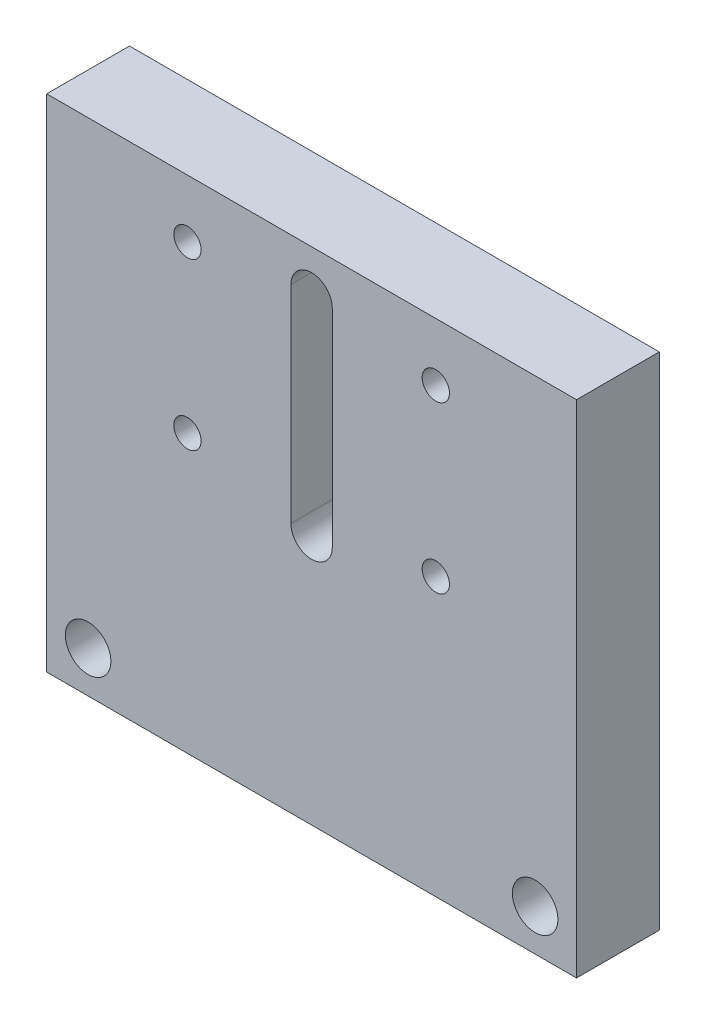
ISO-10303-21;
HEADER;
FILE_DESCRIPTION(('STEP AP214'),'2;1');
FILE_NAME('part.step','',(''),(''),'','','');
FILE_SCHEMA(('AUTOMOTIVE_DESIGN { 1 0 10303 214 1 1 1 1 }'));
ENDSEC;
DATA;
#1=APPLICATION_CONTEXT('core data for automotive mechanical design processes');
#2=APPLICATION_PROTOCOL_DEFINITION('international standard','automotive_design',2000,#1);
#3=PRODUCT_CONTEXT('',#1,'mechanical');
#4=PRODUCT('Part','Part','',(#3));
#5=PRODUCT_RELATED_PRODUCT_CATEGORY('part','',(#4));
#6=PRODUCT_DEFINITION_FORMATION('','',#4);
#7=PRODUCT_DEFINITION_CONTEXT('part definition',#1,'design');
#8=PRODUCT_DEFINITION('design','',#6,#7);
#9=PRODUCT_DEFINITION_SHAPE('','',#8);
#10=(LENGTH_UNIT() NAMED_UNIT(*) SI_UNIT(.MILLI.,.METRE.));
#11=(NAMED_UNIT(*) PLANE_ANGLE_UNIT() SI_UNIT($,.RADIAN.));
#12=(NAMED_UNIT(*) SI_UNIT($,.STERADIAN.) SOLID_ANGLE_UNIT());
#13=UNCERTAINTY_MEASURE_WITH_UNIT(LENGTH_MEASURE(1.E-05),#10,'distance_accuracy_value','');
#14=(GEOMETRIC_REPRESENTATION_CONTEXT(3) GLOBAL_UNCERTAINTY_ASSIGNED_CONTEXT((#13)) GLOBAL_UNIT_ASSIGNED_CONTEXT((#10,
#11,#12)) REPRESENTATION_CONTEXT('',''));
#15=CARTESIAN_POINT('',(0.,0.,0.));
#16=DIRECTION('',(0.,0.,1.));
#17=DIRECTION('',(1.,0.,0.));
#18=AXIS2_PLACEMENT_3D('',#15,#16,#17);
#19=CARTESIAN_POINT('',(64.,60.5,-10.));
#20=DIRECTION('',(0.,-1.,0.));
#21=DIRECTION('',(0.,0.,-1.));
#22=AXIS2_PLACEMENT_3D('',#19,#20,#21);
#23=PLANE('',#22);
#24=DIRECTION('',(0.,0.,1.));
#25=VECTOR('',#24,1.);
#26=CARTESIAN_POINT('',(0.,60.5,-10.));
#27=LINE('',#26,#25);
#28=CARTESIAN_POINT('',(0.,60.5,-10.));
#29=VERTEX_POINT('',#28);
#30=CARTESIAN_POINT('',(0.,60.5,0.));
#31=VERTEX_POINT('',#30);
#32=EDGE_CURVE('E127',#29,#31,#27,.T.);
#33=ORIENTED_EDGE('',*,*,#32,.T.);
#34=DIRECTION('',(-1.,0.,0.));
#35=VECTOR('',#34,1.);
#36=CARTESIAN_POINT('',(64.,60.5,0.));
#37=LINE('',#36,#35);
#38=CARTESIAN_POINT('',(64.,60.5,0.));
#39=VERTEX_POINT('',#38);
#40=EDGE_CURVE('E11',#39,#31,#37,.T.);
#41=ORIENTED_EDGE('',*,*,#40,.F.);
#42=DIRECTION('',(0.,0.,1.));
#43=VECTOR('',#42,1.);
#44=CARTESIAN_POINT('',(64.,60.5,-10.));
#45=LINE('',#44,#43);
#46=CARTESIAN_POINT('',(64.,60.5,-10.));
#47=VERTEX_POINT('',#46);
#48=EDGE_CURVE('E123',#47,#39,#45,.T.);
#49=ORIENTED_EDGE('',*,*,#48,.F.);
#50=DIRECTION('',(-1.,0.,0.));
#51=VECTOR('',#50,1.);
#52=CARTESIAN_POINT('',(64.,60.5,-10.));
#53=LINE('',#52,#51);
#54=EDGE_CURVE('E104',#47,#29,#53,.T.);
#55=ORIENTED_EDGE('',*,*,#54,.T.);
#56=EDGE_LOOP('',(#33,#41,#49,#55));
#57=FACE_BOUND('',#56,.T.);
#58=ADVANCED_FACE('F34',(#57),#23,.F.);
#59=CARTESIAN_POINT('',(64.,60.5,0.));
#60=DIRECTION('',(0.,0.,-1.));
#61=DIRECTION('',(0.,1.,0.));
#62=AXIS2_PLACEMENT_3D('',#59,#60,#61);
#63=PLANE('',#62);
#64=CARTESIAN_POINT('',(17.,53.5,0.));
#65=DIRECTION('',(0.,0.,-1.));
#66=DIRECTION('',(0.,1.,0.));
#67=AXIS2_PLACEMENT_3D('',#64,#65,#66);
#68=CIRCLE('',#67,1.65);
#69=CARTESIAN_POINT('',(17.,55.15,0.));
#70=VERTEX_POINT('',#69);
#71=EDGE_CURVE('E198',#70,#70,#68,.T.);
#72=ORIENTED_EDGE('',*,*,#71,.T.);
#73=EDGE_LOOP('',(#72));
#74=FACE_BOUND('',#73,.T.);
#75=CARTESIAN_POINT('',(47.,33.5,0.));
#76=DIRECTION('',(0.,0.,-1.));
#77=DIRECTION('',(0.,1.,0.));
#78=AXIS2_PLACEMENT_3D('',#75,#76,#77);
#79=CIRCLE('',#78,1.65);
#80=CARTESIAN_POINT('',(47.,35.15,0.));
#81=VERTEX_POINT('',#80);
#82=EDGE_CURVE('E192',#81,#81,#79,.T.);
#83=ORIENTED_EDGE('',*,*,#82,.T.);
#84=EDGE_LOOP('',(#83));
#85=FACE_BOUND('',#84,.T.);
#86=CARTESIAN_POINT('',(17.,33.5,0.));
#87=DIRECTION('',(0.,0.,-1.));
#88=DIRECTION('',(0.,1.,0.));
#89=AXIS2_PLACEMENT_3D('',#86,#87,#88);
#90=CIRCLE('',#89,1.65);
#91=CARTESIAN_POINT('',(17.,35.15,0.));
#92=VERTEX_POINT('',#91);
#93=EDGE_CURVE('E186',#92,#92,#90,.T.);
#94=ORIENTED_EDGE('',*,*,#93,.T.);
#95=EDGE_LOOP('',(#94));
#96=FACE_BOUND('',#95,.T.);
#97=CARTESIAN_POINT('',(47.,53.5,0.));
#98=DIRECTION('',(0.,0.,-1.));
#99=DIRECTION('',(0.,1.,0.));
#100=AXIS2_PLACEMENT_3D('',#97,#98,#99);
#101=CIRCLE('',#100,1.65);
#102=CARTESIAN_POINT('',(47.,55.15,0.));
#103=VERTEX_POINT('',#102);
#104=EDGE_CURVE('E178',#103,#103,#101,.T.);
#105=ORIENTED_EDGE('',*,*,#104,.T.);
#106=EDGE_LOOP('',(#105));
#107=FACE_BOUND('',#106,.T.);
#108=CARTESIAN_POINT('',(5.,5.,0.));
#109=DIRECTION('',(0.,0.,-1.));
#110=DIRECTION('',(-1.,0.,0.));
#111=AXIS2_PLACEMENT_3D('',#108,#109,#110);
#112=CIRCLE('',#111,2.75);
#113=CARTESIAN_POINT('',(2.25,5.,0.));
#114=VERTEX_POINT('',#113);
#115=EDGE_CURVE('E175',#114,#114,#112,.T.);
#116=ORIENTED_EDGE('',*,*,#115,.T.);
#117=EDGE_LOOP('',(#116));
#118=FACE_BOUND('',#117,.T.);
#119=CARTESIAN_POINT('',(59.,5.,0.));
#120=DIRECTION('',(0.,0.,1.));
#121=DIRECTION('',(1.,0.,0.));
#122=AXIS2_PLACEMENT_3D('',#119,#120,#121);
#123=CIRCLE('',#122,2.75);
#124=CARTESIAN_POINT('',(61.75,5.,0.));
#125=VERTEX_POINT('',#124);
#126=EDGE_CURVE('E169',#125,#125,#123,.T.);
#127=ORIENTED_EDGE('',*,*,#126,.F.);
#128=EDGE_LOOP('',(#127));
#129=FACE_BOUND('',#128,.T.);
#130=DIRECTION('',(0.,1.,0.));
#131=VECTOR('',#130,1.);
#132=CARTESIAN_POINT('',(29.5,55.3,0.));
#133=LINE('',#132,#131);
#134=CARTESIAN_POINT('',(29.5,30.3,0.));
#135=VERTEX_POINT('',#134);
#136=CARTESIAN_POINT('',(29.5,55.3,0.));
#137=VERTEX_POINT('',#136);
#138=EDGE_CURVE('E145',#135,#137,#133,.T.);
#139=ORIENTED_EDGE('',*,*,#138,.T.);
#140=CARTESIAN_POINT('',(32.,55.3,0.));
#141=DIRECTION('',(0.,0.,-1.));
#142=DIRECTION('',(0.,1.,0.));
#143=AXIS2_PLACEMENT_3D('',#140,#141,#142);
#144=CIRCLE('',#143,2.5);
#145=CARTESIAN_POINT('',(34.5,55.3,0.));
#146=VERTEX_POINT('',#145);
#147=EDGE_CURVE('E153',#137,#146,#144,.T.);
#148=ORIENTED_EDGE('',*,*,#147,.T.);
#149=DIRECTION('',(0.,-1.,0.));
#150=VECTOR('',#149,1.);
#151=CARTESIAN_POINT('',(34.5,55.3,0.));
#152=LINE('',#151,#150);
#153=CARTESIAN_POINT('',(34.5,30.3,0.));
#154=VERTEX_POINT('',#153);
#155=EDGE_CURVE('E164',#146,#154,#152,.T.);
#156=ORIENTED_EDGE('',*,*,#155,.T.);
#157=CARTESIAN_POINT('',(32.,30.3,0.));
#158=DIRECTION('',(0.,0.,-1.));
#159=DIRECTION('',(0.,1.,0.));
#160=AXIS2_PLACEMENT_3D('',#157,#158,#159);
#161=CIRCLE('',#160,2.5);
#162=EDGE_CURVE('E56',#154,#135,#161,.T.);
#163=ORIENTED_EDGE('',*,*,#162,.T.);
#164=EDGE_LOOP('',(#139,#148,#156,#163));
#165=FACE_BOUND('',#164,.T.);
#166=DIRECTION('',(0.,-1.,0.));
#167=VECTOR('',#166,1.);
#168=CARTESIAN_POINT('',(0.,60.5,0.));
#169=LINE('',#168,#167);
#170=CARTESIAN_POINT('',(0.,0.,0.));
#171=VERTEX_POINT('',#170);
#172=EDGE_CURVE('E130',#31,#171,#169,.T.);
#173=ORIENTED_EDGE('',*,*,#172,.T.);
#174=DIRECTION('',(-1.,0.,0.));
#175=VECTOR('',#174,1.);
#176=CARTESIAN_POINT('',(64.,0.,0.));
#177=LINE('',#176,#175);
#178=CARTESIAN_POINT('',(64.,0.,0.));
#179=VERTEX_POINT('',#178);
#180=EDGE_CURVE('E41',#179,#171,#177,.T.);
#181=ORIENTED_EDGE('',*,*,#180,.F.);
#182=DIRECTION('',(0.,-1.,0.));
#183=VECTOR('',#182,1.);
#184=CARTESIAN_POINT('',(64.,60.5,0.));
#185=LINE('',#184,#183);
#186=EDGE_CURVE('E120',#39,#179,#185,.T.);
#187=ORIENTED_EDGE('',*,*,#186,.F.);
#188=ORIENTED_EDGE('',*,*,#40,.T.);
#189=EDGE_LOOP('',(#173,#181,#187,#188));
#190=FACE_BOUND('',#189,.T.);
#191=ADVANCED_FACE('F138',(#74,#85,#96,#107,#118,#129,#165,#190),#63,.F.);
#192=CARTESIAN_POINT('',(64.,0.,0.));
#193=DIRECTION('',(0.,1.,0.));
#194=DIRECTION('',(0.,0.,1.));
#195=AXIS2_PLACEMENT_3D('',#192,#193,#194);
#196=PLANE('',#195);
#197=DIRECTION('',(0.,0.,-1.));
#198=VECTOR('',#197,1.);
#199=CARTESIAN_POINT('',(0.,0.,0.));
#200=LINE('',#199,#198);
#201=CARTESIAN_POINT('',(0.,0.,-10.));
#202=VERTEX_POINT('',#201);
#203=EDGE_CURVE('E115',#171,#202,#200,.T.);
#204=ORIENTED_EDGE('',*,*,#203,.T.);
#205=DIRECTION('',(1.,0.,0.));
#206=VECTOR('',#205,1.);
#207=CARTESIAN_POINT('',(64.,0.,-10.));
#208=LINE('',#207,#206);
#209=CARTESIAN_POINT('',(64.,0.,-10.));
#210=VERTEX_POINT('',#209);
#211=EDGE_CURVE('E101',#202,#210,#208,.T.);
#212=ORIENTED_EDGE('',*,*,#211,.T.);
#213=DIRECTION('',(0.,0.,-1.));
#214=VECTOR('',#213,1.);
#215=CARTESIAN_POINT('',(64.,0.,0.));
#216=LINE('',#215,#214);
#217=EDGE_CURVE('E109',#179,#210,#216,.T.);
#218=ORIENTED_EDGE('',*,*,#217,.F.);
#219=ORIENTED_EDGE('',*,*,#180,.T.);
#220=EDGE_LOOP('',(#204,#212,#218,#219));
#221=FACE_BOUND('',#220,.T.);
#222=ADVANCED_FACE('F113',(#221),#196,.F.);
#223=CARTESIAN_POINT('',(64.,9.99999999999999,-9.99999999999999));
#224=DIRECTION('',(0.,0.,1.));
#225=DIRECTION('',(0.,-1.,0.));
#226=AXIS2_PLACEMENT_3D('',#223,#224,#225);
#227=PLANE('',#226);
#228=CARTESIAN_POINT('',(17.,53.5,-10.));
#229=DIRECTION('',(0.,0.,-1.));
#230=DIRECTION('',(0.,1.,0.));
#231=AXIS2_PLACEMENT_3D('',#228,#229,#230);
#232=CIRCLE('',#231,1.64999999999999);
#233=CARTESIAN_POINT('',(17.,55.15,-10.));
#234=VERTEX_POINT('',#233);
#235=EDGE_CURVE('E201',#234,#234,#232,.T.);
#236=ORIENTED_EDGE('',*,*,#235,.F.);
#237=EDGE_LOOP('',(#236));
#238=FACE_BOUND('',#237,.T.);
#239=CARTESIAN_POINT('',(47.,33.5,-10.));
#240=DIRECTION('',(0.,0.,-1.));
#241=DIRECTION('',(0.,1.,0.));
#242=AXIS2_PLACEMENT_3D('',#239,#240,#241);
#243=CIRCLE('',#242,1.64999999999998);
#244=CARTESIAN_POINT('',(47.,35.15,-10.));
#245=VERTEX_POINT('',#244);
#246=EDGE_CURVE('E195',#245,#245,#243,.T.);
#247=ORIENTED_EDGE('',*,*,#246,.F.);
#248=EDGE_LOOP('',(#247));
#249=FACE_BOUND('',#248,.T.);
#250=CARTESIAN_POINT('',(17.,33.5,-10.));
#251=DIRECTION('',(0.,0.,-1.));
#252=DIRECTION('',(0.,1.,0.));
#253=AXIS2_PLACEMENT_3D('',#250,#251,#252);
#254=CIRCLE('',#253,1.64999999999999);
#255=CARTESIAN_POINT('',(17.,35.15,-10.));
#256=VERTEX_POINT('',#255);
#257=EDGE_CURVE('E189',#256,#256,#254,.T.);
#258=ORIENTED_EDGE('',*,*,#257,.F.);
#259=EDGE_LOOP('',(#258));
#260=FACE_BOUND('',#259,.T.);
#261=CARTESIAN_POINT('',(47.,53.5,-10.));
#262=DIRECTION('',(0.,0.,-1.));
#263=DIRECTION('',(0.,1.,0.));
#264=AXIS2_PLACEMENT_3D('',#261,#262,#263);
#265=CIRCLE('',#264,1.64999999999998);
#266=CARTESIAN_POINT('',(47.,55.15,-10.));
#267=VERTEX_POINT('',#266);
#268=EDGE_CURVE('E183',#267,#267,#265,.T.);
#269=ORIENTED_EDGE('',*,*,#268,.F.);
#270=EDGE_LOOP('',(#269));
#271=FACE_BOUND('',#270,.T.);
#272=CARTESIAN_POINT('',(5.,5.,-10.));
#273=DIRECTION('',(0.,0.,-1.));
#274=DIRECTION('',(-1.,0.,0.));
#275=AXIS2_PLACEMENT_3D('',#272,#273,#274);
#276=CIRCLE('',#275,2.75);
#277=CARTESIAN_POINT('',(2.25,5.,-10.));
#278=VERTEX_POINT('',#277);
#279=EDGE_CURVE('E172',#278,#278,#276,.T.);
#280=ORIENTED_EDGE('',*,*,#279,.F.);
#281=EDGE_LOOP('',(#280));
#282=FACE_BOUND('',#281,.T.);
#283=CARTESIAN_POINT('',(59.,5.,-10.));
#284=DIRECTION('',(0.,0.,1.));
#285=DIRECTION('',(1.,0.,0.));
#286=AXIS2_PLACEMENT_3D('',#283,#284,#285);
#287=CIRCLE('',#286,2.75);
#288=CARTESIAN_POINT('',(61.75,5.,-10.));
#289=VERTEX_POINT('',#288);
#290=EDGE_CURVE('E117',#289,#289,#287,.T.);
#291=ORIENTED_EDGE('',*,*,#290,.T.);
#292=EDGE_LOOP('',(#291));
#293=FACE_BOUND('',#292,.T.);
#294=DIRECTION('',(0.,-1.,0.));
#295=VECTOR('',#294,1.);
#296=CARTESIAN_POINT('',(34.5,55.3,-9.99999999999999));
#297=LINE('',#296,#295);
#298=CARTESIAN_POINT('',(34.5,55.3,-10.));
#299=VERTEX_POINT('',#298);
#300=CARTESIAN_POINT('',(34.5,30.3,-9.99999999999999));
#301=VERTEX_POINT('',#300);
#302=EDGE_CURVE('E157',#299,#301,#297,.T.);
#303=ORIENTED_EDGE('',*,*,#302,.F.);
#304=CARTESIAN_POINT('',(32.,55.3,-9.99999999999999));
#305=DIRECTION('',(0.,0.,-1.));
#306=DIRECTION('',(0.,1.,0.));
#307=AXIS2_PLACEMENT_3D('',#304,#305,#306);
#308=CIRCLE('',#307,2.5);
#309=CARTESIAN_POINT('',(29.5,55.3,-9.99999999999999));
#310=VERTEX_POINT('',#309);
#311=EDGE_CURVE('E116',#310,#299,#308,.T.);
#312=ORIENTED_EDGE('',*,*,#311,.F.);
#313=DIRECTION('',(0.,1.,0.));
#314=VECTOR('',#313,1.);
#315=CARTESIAN_POINT('',(29.5,55.3,-9.99999999999999));
#316=LINE('',#315,#314);
#317=CARTESIAN_POINT('',(29.5,30.3,-9.99999999999999));
#318=VERTEX_POINT('',#317);
#319=EDGE_CURVE('E150',#318,#310,#316,.T.);
#320=ORIENTED_EDGE('',*,*,#319,.F.);
#321=CARTESIAN_POINT('',(32.,30.3,-9.99999999999999));
#322=DIRECTION('',(0.,0.,-1.));
#323=DIRECTION('',(0.,1.,0.));
#324=AXIS2_PLACEMENT_3D('',#321,#322,#323);
#325=CIRCLE('',#324,2.5);
#326=EDGE_CURVE('E154',#301,#318,#325,.T.);
#327=ORIENTED_EDGE('',*,*,#326,.F.);
#328=EDGE_LOOP('',(#303,#312,#320,#327));
#329=FACE_BOUND('',#328,.T.);
#330=DIRECTION('',(0.,1.,0.));
#331=VECTOR('',#330,1.);
#332=CARTESIAN_POINT('',(0.,9.99999999999999,-9.99999999999999));
#333=LINE('',#332,#331);
#334=EDGE_CURVE('E48',#202,#29,#333,.T.);
#335=ORIENTED_EDGE('',*,*,#334,.T.);
#336=ORIENTED_EDGE('',*,*,#54,.F.);
#337=DIRECTION('',(0.,1.,0.));
#338=VECTOR('',#337,1.);
#339=CARTESIAN_POINT('',(64.,9.99999999999999,-9.99999999999999));
#340=LINE('',#339,#338);
#341=EDGE_CURVE('E98',#210,#47,#340,.T.);
#342=ORIENTED_EDGE('',*,*,#341,.F.);
#343=ORIENTED_EDGE('',*,*,#211,.F.);
#344=EDGE_LOOP('',(#335,#336,#342,#343));
#345=FACE_BOUND('',#344,.T.);
#346=ADVANCED_FACE('F100',(#238,#249,#260,#271,#282,#293,#329,#345),#227,.F.);
#347=CARTESIAN_POINT('',(64.,0.,0.));
#348=DIRECTION('',(1.,0.,0.));
#349=DIRECTION('',(0.,0.,-1.));
#350=AXIS2_PLACEMENT_3D('',#347,#348,#349);
#351=PLANE('',#350);
#352=ORIENTED_EDGE('',*,*,#217,.T.);
#353=ORIENTED_EDGE('',*,*,#341,.T.);
#354=ORIENTED_EDGE('',*,*,#48,.T.);
#355=ORIENTED_EDGE('',*,*,#186,.T.);
#356=EDGE_LOOP('',(#352,#353,#354,#355));
#357=FACE_BOUND('',#356,.T.);
#358=ADVANCED_FACE('F119',(#357),#351,.T.);
#359=CARTESIAN_POINT('',(0.,0.,0.));
#360=DIRECTION('',(1.,0.,0.));
#361=DIRECTION('',(0.,0.,-1.));
#362=AXIS2_PLACEMENT_3D('',#359,#360,#361);
#363=PLANE('',#362);
#364=ORIENTED_EDGE('',*,*,#334,.F.);
#365=ORIENTED_EDGE('',*,*,#203,.F.);
#366=ORIENTED_EDGE('',*,*,#172,.F.);
#367=ORIENTED_EDGE('',*,*,#32,.F.);
#368=EDGE_LOOP('',(#364,#365,#366,#367));
#369=FACE_BOUND('',#368,.T.);
#370=ADVANCED_FACE('F136',(#369),#363,.F.);
#371=CARTESIAN_POINT('',(32.,55.3,0.));
#372=DIRECTION('',(0.,0.,-1.));
#373=DIRECTION('',(0.,1.,0.));
#374=AXIS2_PLACEMENT_3D('',#371,#372,#373);
#375=CYLINDRICAL_SURFACE('',#374,2.5);
#376=ORIENTED_EDGE('',*,*,#311,.T.);
#377=DIRECTION('',(0.,0.,-1.));
#378=VECTOR('',#377,1.);
#379=CARTESIAN_POINT('',(34.5,55.3,0.));
#380=LINE('',#379,#378);
#381=EDGE_CURVE('E141',#146,#299,#380,.T.);
#382=ORIENTED_EDGE('',*,*,#381,.F.);
#383=ORIENTED_EDGE('',*,*,#147,.F.);
#384=DIRECTION('',(0.,0.,-1.));
#385=VECTOR('',#384,1.);
#386=CARTESIAN_POINT('',(29.5,55.3,0.));
#387=LINE('',#386,#385);
#388=EDGE_CURVE('E131',#137,#310,#387,.T.);
#389=ORIENTED_EDGE('',*,*,#388,.T.);
#390=EDGE_LOOP('',(#376,#382,#383,#389));
#391=FACE_BOUND('',#390,.T.);
#392=ADVANCED_FACE('F229',(#391),#375,.F.);
#393=CARTESIAN_POINT('',(29.5,55.3,0.));
#394=DIRECTION('',(-1.,0.,0.));
#395=DIRECTION('',(0.,-1.,0.));
#396=AXIS2_PLACEMENT_3D('',#393,#394,#395);
#397=PLANE('',#396);
#398=ORIENTED_EDGE('',*,*,#319,.T.);
#399=ORIENTED_EDGE('',*,*,#388,.F.);
#400=ORIENTED_EDGE('',*,*,#138,.F.);
#401=DIRECTION('',(0.,0.,-1.));
#402=VECTOR('',#401,1.);
#403=CARTESIAN_POINT('',(29.5,30.3,0.));
#404=LINE('',#403,#402);
#405=EDGE_CURVE('E147',#135,#318,#404,.T.);
#406=ORIENTED_EDGE('',*,*,#405,.T.);
#407=EDGE_LOOP('',(#398,#399,#400,#406));
#408=FACE_BOUND('',#407,.T.);
#409=ADVANCED_FACE('F232',(#408),#397,.F.);
#410=CARTESIAN_POINT('',(32.,30.3,0.));
#411=DIRECTION('',(0.,0.,-1.));
#412=DIRECTION('',(0.,1.,0.));
#413=AXIS2_PLACEMENT_3D('',#410,#411,#412);
#414=CYLINDRICAL_SURFACE('',#413,2.5);
#415=ORIENTED_EDGE('',*,*,#326,.T.);
#416=ORIENTED_EDGE('',*,*,#405,.F.);
#417=ORIENTED_EDGE('',*,*,#162,.F.);
#418=DIRECTION('',(0.,0.,-1.));
#419=VECTOR('',#418,1.);
#420=CARTESIAN_POINT('',(34.5,30.3,0.));
#421=LINE('',#420,#419);
#422=EDGE_CURVE('E144',#154,#301,#421,.T.);
#423=ORIENTED_EDGE('',*,*,#422,.T.);
#424=EDGE_LOOP('',(#415,#416,#417,#423));
#425=FACE_BOUND('',#424,.T.);
#426=ADVANCED_FACE('F233',(#425),#414,.F.);
#427=CARTESIAN_POINT('',(34.5,55.3,0.));
#428=DIRECTION('',(1.,0.,0.));
#429=DIRECTION('',(0.,0.,-1.));
#430=AXIS2_PLACEMENT_3D('',#427,#428,#429);
#431=PLANE('',#430);
#432=ORIENTED_EDGE('',*,*,#302,.T.);
#433=ORIENTED_EDGE('',*,*,#422,.F.);
#434=ORIENTED_EDGE('',*,*,#155,.F.);
#435=ORIENTED_EDGE('',*,*,#381,.T.);
#436=EDGE_LOOP('',(#432,#433,#434,#435));
#437=FACE_BOUND('',#436,.T.);
#438=ADVANCED_FACE('F225',(#437),#431,.F.);
#439=CARTESIAN_POINT('',(59.,5.,-10.));
#440=DIRECTION('',(0.,0.,1.));
#441=DIRECTION('',(1.,0.,0.));
#442=AXIS2_PLACEMENT_3D('',#439,#440,#441);
#443=CYLINDRICAL_SURFACE('',#442,2.75);
#444=ORIENTED_EDGE('',*,*,#290,.F.);
#445=EDGE_LOOP('',(#444));
#446=FACE_BOUND('',#445,.T.);
#447=ORIENTED_EDGE('',*,*,#126,.T.);
#448=EDGE_LOOP('',(#447));
#449=FACE_BOUND('',#448,.T.);
#450=ADVANCED_FACE('F240',(#446,#449),#443,.F.);
#451=CARTESIAN_POINT('',(5.,5.,-10.));
#452=DIRECTION('',(0.,0.,1.));
#453=DIRECTION('',(1.,0.,0.));
#454=AXIS2_PLACEMENT_3D('',#451,#452,#453);
#455=CYLINDRICAL_SURFACE('',#454,2.75);
#456=ORIENTED_EDGE('',*,*,#279,.T.);
#457=EDGE_LOOP('',(#456));
#458=FACE_BOUND('',#457,.T.);
#459=ORIENTED_EDGE('',*,*,#115,.F.);
#460=EDGE_LOOP('',(#459));
#461=FACE_BOUND('',#460,.T.);
#462=ADVANCED_FACE('F305',(#458,#461),#455,.F.);
#463=CARTESIAN_POINT('',(47.,53.5,-10.));
#464=DIRECTION('',(0.,0.,-1.));
#465=DIRECTION('',(0.,1.,0.));
#466=AXIS2_PLACEMENT_3D('',#463,#464,#465);
#467=CYLINDRICAL_SURFACE('',#466,1.64999999999999);
#468=ORIENTED_EDGE('',*,*,#104,.F.);
#469=EDGE_LOOP('',(#468));
#470=FACE_BOUND('',#469,.T.);
#471=ORIENTED_EDGE('',*,*,#268,.T.);
#472=EDGE_LOOP('',(#471));
#473=FACE_BOUND('',#472,.T.);
#474=ADVANCED_FACE('F314',(#470,#473),#467,.F.);
#475=CARTESIAN_POINT('',(17.,33.5,-10.));
#476=DIRECTION('',(0.,0.,-1.));
#477=DIRECTION('',(0.,1.,0.));
#478=AXIS2_PLACEMENT_3D('',#475,#476,#477);
#479=CYLINDRICAL_SURFACE('',#478,1.64999999999999);
#480=ORIENTED_EDGE('',*,*,#93,.F.);
#481=EDGE_LOOP('',(#480));
#482=FACE_BOUND('',#481,.T.);
#483=ORIENTED_EDGE('',*,*,#257,.T.);
#484=EDGE_LOOP('',(#483));
#485=FACE_BOUND('',#484,.T.);
#486=ADVANCED_FACE('F335',(#482,#485),#479,.F.);
#487=CARTESIAN_POINT('',(47.,33.5,-10.));
#488=DIRECTION('',(0.,0.,-1.));
#489=DIRECTION('',(0.,1.,0.));
#490=AXIS2_PLACEMENT_3D('',#487,#488,#489);
#491=CYLINDRICAL_SURFACE('',#490,1.64999999999999);
#492=ORIENTED_EDGE('',*,*,#82,.F.);
#493=EDGE_LOOP('',(#492));
#494=FACE_BOUND('',#493,.T.);
#495=ORIENTED_EDGE('',*,*,#246,.T.);
#496=EDGE_LOOP('',(#495));
#497=FACE_BOUND('',#496,.T.);
#498=ADVANCED_FACE('F347',(#494,#497),#491,.F.);
#499=CARTESIAN_POINT('',(17.,53.5,-10.));
#500=DIRECTION('',(0.,0.,-1.));
#501=DIRECTION('',(0.,1.,0.));
#502=AXIS2_PLACEMENT_3D('',#499,#500,#501);
#503=CYLINDRICAL_SURFACE('',#502,1.64999999999999);
#504=ORIENTED_EDGE('',*,*,#71,.F.);
#505=EDGE_LOOP('',(#504));
#506=FACE_BOUND('',#505,.T.);
#507=ORIENTED_EDGE('',*,*,#235,.T.);
#508=EDGE_LOOP('',(#507));
#509=FACE_BOUND('',#508,.T.);
#510=ADVANCED_FACE('F205',(#506,#509),#503,.F.);
#511=CLOSED_SHELL('',(#58,#191,#222,#346,#358,#370,#392,#409,#426,#438,#450,#462,#474,#486,#498,#510));
#512=MANIFOLD_SOLID_BREP('B2',#511);
#513=ADVANCED_BREP_SHAPE_REPRESENTATION('',(#18,#512),#14);
#514=SHAPE_DEFINITION_REPRESENTATION(#9,#513);
ENDSEC;
END-ISO-10303-21;
